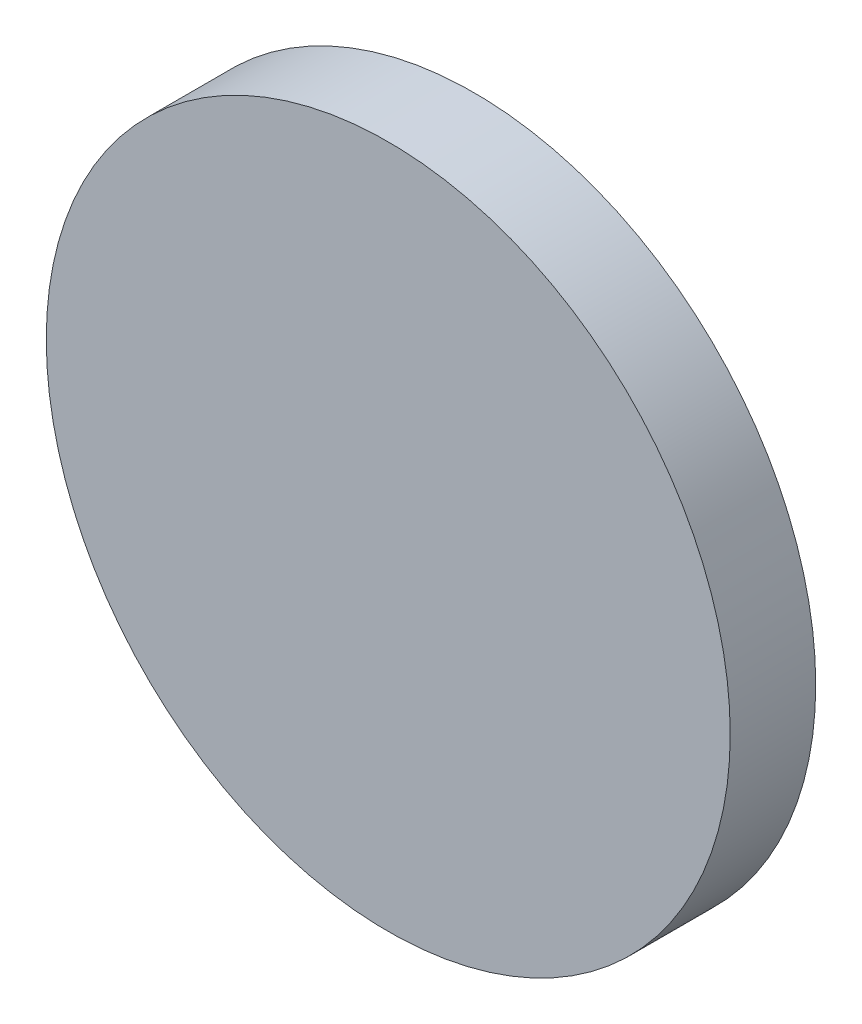
ISO-10303-21;
HEADER;
FILE_DESCRIPTION(('STEP AP214'),'2;1');
FILE_NAME('part.step','',(''),(''),'','','');
FILE_SCHEMA(('AUTOMOTIVE_DESIGN { 1 0 10303 214 1 1 1 1 }'));
ENDSEC;
DATA;
#1=APPLICATION_CONTEXT('core data for automotive mechanical design processes');
#2=APPLICATION_PROTOCOL_DEFINITION('international standard','automotive_design',2000,#1);
#3=PRODUCT_CONTEXT('',#1,'mechanical');
#4=PRODUCT('Part','Part','',(#3));
#5=PRODUCT_RELATED_PRODUCT_CATEGORY('part','',(#4));
#6=PRODUCT_DEFINITION_FORMATION('','',#4);
#7=PRODUCT_DEFINITION_CONTEXT('part definition',#1,'design');
#8=PRODUCT_DEFINITION('design','',#6,#7);
#9=PRODUCT_DEFINITION_SHAPE('','',#8);
#10=(LENGTH_UNIT() NAMED_UNIT(*) SI_UNIT(.MILLI.,.METRE.));
#11=(NAMED_UNIT(*) PLANE_ANGLE_UNIT() SI_UNIT($,.RADIAN.));
#12=(NAMED_UNIT(*) SI_UNIT($,.STERADIAN.) SOLID_ANGLE_UNIT());
#13=UNCERTAINTY_MEASURE_WITH_UNIT(LENGTH_MEASURE(1.E-05),#10,'distance_accuracy_value','');
#14=(GEOMETRIC_REPRESENTATION_CONTEXT(3) GLOBAL_UNCERTAINTY_ASSIGNED_CONTEXT((#13)) GLOBAL_UNIT_ASSIGNED_CONTEXT((#10,
#11,#12)) REPRESENTATION_CONTEXT('',''));
#15=CARTESIAN_POINT('',(0.,0.,0.));
#16=DIRECTION('',(0.,0.,1.));
#17=DIRECTION('',(1.,0.,0.));
#18=AXIS2_PLACEMENT_3D('',#15,#16,#17);
#19=CARTESIAN_POINT('',(0.,0.,5.));
#20=DIRECTION('',(0.,0.,-1.));
#21=DIRECTION('',(-1.,0.,0.));
#22=AXIS2_PLACEMENT_3D('',#19,#20,#21);
#23=CYLINDRICAL_SURFACE('',#22,20.);
#24=CARTESIAN_POINT('',(0.,0.,5.));
#25=DIRECTION('',(0.,0.,1.));
#26=DIRECTION('',(1.,0.,0.));
#27=AXIS2_PLACEMENT_3D('',#24,#25,#26);
#28=CIRCLE('',#27,20.);
#29=CARTESIAN_POINT('',(20.,0.,5.));
#30=VERTEX_POINT('',#29);
#31=EDGE_CURVE('E10',#30,#30,#28,.T.);
#32=ORIENTED_EDGE('',*,*,#31,.F.);
#33=EDGE_LOOP('',(#32));
#34=FACE_BOUND('',#33,.T.);
#35=CARTESIAN_POINT('',(0.,0.,0.));
#36=DIRECTION('',(0.,0.,1.));
#37=DIRECTION('',(1.,0.,0.));
#38=AXIS2_PLACEMENT_3D('',#35,#36,#37);
#39=CIRCLE('',#38,20.);
#40=CARTESIAN_POINT('',(20.,0.,0.));
#41=VERTEX_POINT('',#40);
#42=EDGE_CURVE('E38',#41,#41,#39,.T.);
#43=ORIENTED_EDGE('',*,*,#42,.T.);
#44=EDGE_LOOP('',(#43));
#45=FACE_BOUND('',#44,.T.);
#46=ADVANCED_FACE('F35',(#34,#45),#23,.T.);
#47=CARTESIAN_POINT('',(0.,0.,5.));
#48=DIRECTION('',(0.,0.,1.));
#49=DIRECTION('',(1.,0.,0.));
#50=AXIS2_PLACEMENT_3D('',#47,#48,#49);
#51=PLANE('',#50);
#52=ORIENTED_EDGE('',*,*,#31,.T.);
#53=EDGE_LOOP('',(#52));
#54=FACE_BOUND('',#53,.T.);
#55=ADVANCED_FACE('F50',(#54),#51,.T.);
#56=CARTESIAN_POINT('',(0.,0.,0.));
#57=DIRECTION('',(0.,0.,1.));
#58=DIRECTION('',(1.,0.,0.));
#59=AXIS2_PLACEMENT_3D('',#56,#57,#58);
#60=PLANE('',#59);
#61=ORIENTED_EDGE('',*,*,#42,.F.);
#62=EDGE_LOOP('',(#61));
#63=FACE_BOUND('',#62,.T.);
#64=ADVANCED_FACE('F48',(#63),#60,.F.);
#65=CLOSED_SHELL('',(#46,#55,#64));
#66=MANIFOLD_SOLID_BREP('B2',#65);
#67=ADVANCED_BREP_SHAPE_REPRESENTATION('',(#18,#66),#14);
#68=SHAPE_DEFINITION_REPRESENTATION(#9,#67);
ENDSEC;
END-ISO-10303-21;
